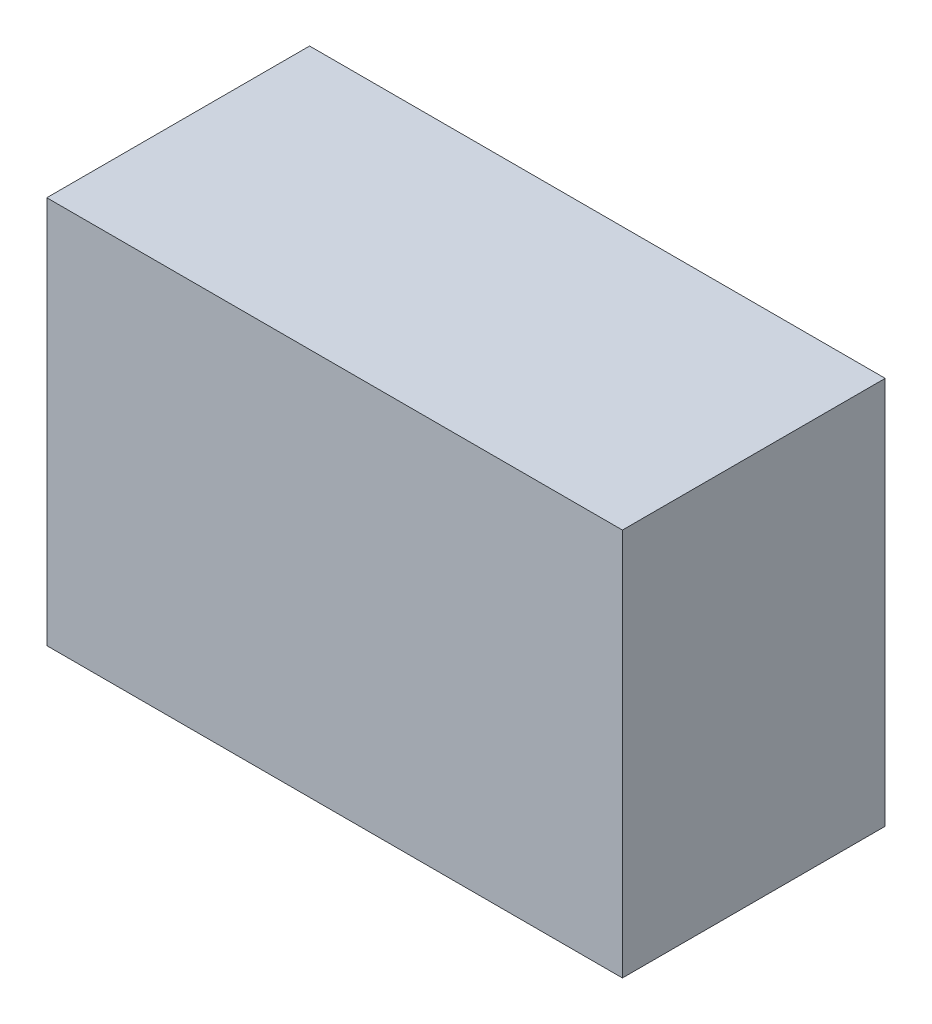
ISO-10303-21;
HEADER;
FILE_DESCRIPTION(('STEP AP214'),'2;1');
FILE_NAME('part.step','',(''),(''),'','','');
FILE_SCHEMA(('AUTOMOTIVE_DESIGN { 1 0 10303 214 1 1 1 1 }'));
ENDSEC;
DATA;
#1=APPLICATION_CONTEXT('core data for automotive mechanical design processes');
#2=APPLICATION_PROTOCOL_DEFINITION('international standard','automotive_design',2000,#1);
#3=PRODUCT_CONTEXT('',#1,'mechanical');
#4=PRODUCT('Part','Part','',(#3));
#5=PRODUCT_RELATED_PRODUCT_CATEGORY('part','',(#4));
#6=PRODUCT_DEFINITION_FORMATION('','',#4);
#7=PRODUCT_DEFINITION_CONTEXT('part definition',#1,'design');
#8=PRODUCT_DEFINITION('design','',#6,#7);
#9=PRODUCT_DEFINITION_SHAPE('','',#8);
#10=(LENGTH_UNIT() NAMED_UNIT(*) SI_UNIT(.MILLI.,.METRE.));
#11=(NAMED_UNIT(*) PLANE_ANGLE_UNIT() SI_UNIT($,.RADIAN.));
#12=(NAMED_UNIT(*) SI_UNIT($,.STERADIAN.) SOLID_ANGLE_UNIT());
#13=UNCERTAINTY_MEASURE_WITH_UNIT(LENGTH_MEASURE(1.E-05),#10,'distance_accuracy_value','');
#14=(GEOMETRIC_REPRESENTATION_CONTEXT(3) GLOBAL_UNCERTAINTY_ASSIGNED_CONTEXT((#13)) GLOBAL_UNIT_ASSIGNED_CONTEXT((#10,
#11,#12)) REPRESENTATION_CONTEXT('',''));
#15=CARTESIAN_POINT('',(0.,0.,0.));
#16=DIRECTION('',(0.,0.,1.));
#17=DIRECTION('',(1.,0.,0.));
#18=AXIS2_PLACEMENT_3D('',#15,#16,#17);
#19=CARTESIAN_POINT('',(-0.999999999999999,5.,9.5));
#20=DIRECTION('',(0.,-1.,0.));
#21=DIRECTION('',(0.,0.,-1.));
#22=AXIS2_PLACEMENT_3D('',#19,#20,#21);
#23=CYLINDRICAL_SURFACE('',#22,1.);
#24=CARTESIAN_POINT('',(-0.999999999999999,5.,9.5));
#25=DIRECTION('',(0.,-1.,0.));
#26=DIRECTION('',(0.,0.,-1.));
#27=AXIS2_PLACEMENT_3D('',#24,#25,#26);
#28=CIRCLE('',#27,1.);
#29=CARTESIAN_POINT('',(-0.999999999999999,5.,8.5));
#30=VERTEX_POINT('',#29);
#31=EDGE_CURVE('E11',#30,#30,#28,.T.);
#32=ORIENTED_EDGE('',*,*,#31,.T.);
#33=EDGE_LOOP('',(#32));
#34=FACE_BOUND('',#33,.T.);
#35=CARTESIAN_POINT('',(-0.999999999999999,-5.,9.5));
#36=DIRECTION('',(0.,-1.,0.));
#37=DIRECTION('',(0.,0.,-1.));
#38=AXIS2_PLACEMENT_3D('',#35,#36,#37);
#39=CIRCLE('',#38,1.);
#40=CARTESIAN_POINT('',(-0.999999999999999,-5.,8.5));
#41=VERTEX_POINT('',#40);
#42=EDGE_CURVE('E56',#41,#41,#39,.T.);
#43=ORIENTED_EDGE('',*,*,#42,.F.);
#44=EDGE_LOOP('',(#43));
#45=FACE_BOUND('',#44,.T.);
#46=ADVANCED_FACE('F50',(#34,#45),#23,.T.);
#47=CARTESIAN_POINT('',(0.,5.,0.));
#48=DIRECTION('',(0.,-1.,0.));
#49=DIRECTION('',(0.,0.,-1.));
#50=AXIS2_PLACEMENT_3D('',#47,#48,#49);
#51=PLANE('',#50);
#52=ORIENTED_EDGE('',*,*,#31,.F.);
#53=EDGE_LOOP('',(#52));
#54=FACE_BOUND('',#53,.T.);
#55=ADVANCED_FACE('F65',(#54),#51,.F.);
#56=CARTESIAN_POINT('',(0.,-5.,0.));
#57=DIRECTION('',(0.,-1.,0.));
#58=DIRECTION('',(0.,0.,-1.));
#59=AXIS2_PLACEMENT_3D('',#56,#57,#58);
#60=PLANE('',#59);
#61=ORIENTED_EDGE('',*,*,#42,.T.);
#62=EDGE_LOOP('',(#61));
#63=FACE_BOUND('',#62,.T.);
#64=ADVANCED_FACE('F62',(#63),#60,.T.);
#65=CLOSED_SHELL('',(#46,#55,#64));
#66=MANIFOLD_SOLID_BREP('B2',#65);
#67=CARTESIAN_POINT('',(-0.999999999999999,5.,11.5));
#68=DIRECTION('',(0.,-1.,0.));
#69=DIRECTION('',(0.,0.,-1.));
#70=AXIS2_PLACEMENT_3D('',#67,#68,#69);
#71=CYLINDRICAL_SURFACE('',#70,1.);
#72=CARTESIAN_POINT('',(-0.999999999999999,5.,11.5));
#73=DIRECTION('',(0.,-1.,0.));
#74=DIRECTION('',(0.,0.,-1.));
#75=AXIS2_PLACEMENT_3D('',#72,#73,#74);
#76=CIRCLE('',#75,1.);
#77=CARTESIAN_POINT('',(-0.999999999999999,5.,10.5));
#78=VERTEX_POINT('',#77);
#79=EDGE_CURVE('E49',#78,#78,#76,.T.);
#80=ORIENTED_EDGE('',*,*,#79,.T.);
#81=EDGE_LOOP('',(#80));
#82=FACE_BOUND('',#81,.T.);
#83=CARTESIAN_POINT('',(-0.999999999999999,-5.,11.5));
#84=DIRECTION('',(0.,-1.,0.));
#85=DIRECTION('',(0.,0.,-1.));
#86=AXIS2_PLACEMENT_3D('',#83,#84,#85);
#87=CIRCLE('',#86,1.);
#88=CARTESIAN_POINT('',(-0.999999999999999,-5.,10.5));
#89=VERTEX_POINT('',#88);
#90=EDGE_CURVE('E106',#89,#89,#87,.T.);
#91=ORIENTED_EDGE('',*,*,#90,.F.);
#92=EDGE_LOOP('',(#91));
#93=FACE_BOUND('',#92,.T.);
#94=ADVANCED_FACE('F100',(#82,#93),#71,.T.);
#95=CARTESIAN_POINT('',(0.,5.,0.));
#96=DIRECTION('',(0.,-1.,0.));
#97=DIRECTION('',(0.,0.,-1.));
#98=AXIS2_PLACEMENT_3D('',#95,#96,#97);
#99=PLANE('',#98);
#100=ORIENTED_EDGE('',*,*,#79,.F.);
#101=EDGE_LOOP('',(#100));
#102=FACE_BOUND('',#101,.T.);
#103=ADVANCED_FACE('F115',(#102),#99,.F.);
#104=CARTESIAN_POINT('',(0.,-5.,0.));
#105=DIRECTION('',(0.,-1.,0.));
#106=DIRECTION('',(0.,0.,-1.));
#107=AXIS2_PLACEMENT_3D('',#104,#105,#106);
#108=PLANE('',#107);
#109=ORIENTED_EDGE('',*,*,#90,.T.);
#110=EDGE_LOOP('',(#109));
#111=FACE_BOUND('',#110,.T.);
#112=ADVANCED_FACE('F112',(#111),#108,.T.);
#113=CLOSED_SHELL('',(#94,#103,#112));
#114=MANIFOLD_SOLID_BREP('B6',#113);
#115=CARTESIAN_POINT('',(0.,0.,21.));
#116=DIRECTION('',(1.,0.,0.));
#117=DIRECTION('',(0.,0.,-1.));
#118=AXIS2_PLACEMENT_3D('',#115,#116,#117);
#119=PLANE('',#118);
#120=DIRECTION('',(0.,-1.,0.));
#121=VECTOR('',#120,1.);
#122=CARTESIAN_POINT('',(0.,0.,0.));
#123=LINE('',#122,#121);
#124=CARTESIAN_POINT('',(0.,31.,0.));
#125=VERTEX_POINT('',#124);
#126=CARTESIAN_POINT('',(0.,0.,0.));
#127=VERTEX_POINT('',#126);
#128=EDGE_CURVE('E204',#125,#127,#123,.T.);
#129=ORIENTED_EDGE('',*,*,#128,.T.);
#130=DIRECTION('',(0.,0.,-1.));
#131=VECTOR('',#130,1.);
#132=CARTESIAN_POINT('',(0.,0.,21.));
#133=LINE('',#132,#131);
#134=CARTESIAN_POINT('',(0.,0.,21.));
#135=VERTEX_POINT('',#134);
#136=EDGE_CURVE('E98',#135,#127,#133,.T.);
#137=ORIENTED_EDGE('',*,*,#136,.F.);
#138=DIRECTION('',(0.,-1.,0.));
#139=VECTOR('',#138,1.);
#140=CARTESIAN_POINT('',(0.,0.,21.));
#141=LINE('',#140,#139);
#142=CARTESIAN_POINT('',(0.,31.,21.));
#143=VERTEX_POINT('',#142);
#144=EDGE_CURVE('E192',#143,#135,#141,.T.);
#145=ORIENTED_EDGE('',*,*,#144,.F.);
#146=DIRECTION('',(0.,0.,-1.));
#147=VECTOR('',#146,1.);
#148=CARTESIAN_POINT('',(0.,31.,21.));
#149=LINE('',#148,#147);
#150=EDGE_CURVE('E200',#143,#125,#149,.T.);
#151=ORIENTED_EDGE('',*,*,#150,.T.);
#152=EDGE_LOOP('',(#129,#137,#145,#151));
#153=FACE_BOUND('',#152,.T.);
#154=ADVANCED_FACE('F141',(#153),#119,.F.);
#155=CARTESIAN_POINT('',(0.,0.,21.));
#156=DIRECTION('',(0.,1.,0.));
#157=DIRECTION('',(0.,0.,1.));
#158=AXIS2_PLACEMENT_3D('',#155,#156,#157);
#159=PLANE('',#158);
#160=DIRECTION('',(1.,0.,0.));
#161=VECTOR('',#160,1.);
#162=CARTESIAN_POINT('',(0.,0.,0.));
#163=LINE('',#162,#161);
#164=CARTESIAN_POINT('',(46.,0.,0.));
#165=VERTEX_POINT('',#164);
#166=EDGE_CURVE('E196',#127,#165,#163,.T.);
#167=ORIENTED_EDGE('',*,*,#166,.T.);
#168=DIRECTION('',(0.,0.,-1.));
#169=VECTOR('',#168,1.);
#170=CARTESIAN_POINT('',(46.,0.,21.));
#171=LINE('',#170,#169);
#172=CARTESIAN_POINT('',(46.,0.,21.));
#173=VERTEX_POINT('',#172);
#174=EDGE_CURVE('E149',#173,#165,#171,.T.);
#175=ORIENTED_EDGE('',*,*,#174,.F.);
#176=DIRECTION('',(1.,0.,0.));
#177=VECTOR('',#176,1.);
#178=CARTESIAN_POINT('',(0.,0.,21.));
#179=LINE('',#178,#177);
#180=EDGE_CURVE('E187',#135,#173,#179,.T.);
#181=ORIENTED_EDGE('',*,*,#180,.F.);
#182=ORIENTED_EDGE('',*,*,#136,.T.);
#183=EDGE_LOOP('',(#167,#175,#181,#182));
#184=FACE_BOUND('',#183,.T.);
#185=ADVANCED_FACE('F195',(#184),#159,.F.);
#186=CARTESIAN_POINT('',(46.,0.,21.));
#187=DIRECTION('',(-1.,0.,0.));
#188=DIRECTION('',(0.,0.,1.));
#189=AXIS2_PLACEMENT_3D('',#186,#187,#188);
#190=PLANE('',#189);
#191=DIRECTION('',(0.,1.,0.));
#192=VECTOR('',#191,1.);
#193=CARTESIAN_POINT('',(46.,0.,0.));
#194=LINE('',#193,#192);
#195=CARTESIAN_POINT('',(46.,31.,0.));
#196=VERTEX_POINT('',#195);
#197=EDGE_CURVE('E174',#165,#196,#194,.T.);
#198=ORIENTED_EDGE('',*,*,#197,.T.);
#199=DIRECTION('',(0.,0.,-1.));
#200=VECTOR('',#199,1.);
#201=CARTESIAN_POINT('',(46.,31.,21.));
#202=LINE('',#201,#200);
#203=CARTESIAN_POINT('',(46.,31.,21.));
#204=VERTEX_POINT('',#203);
#205=EDGE_CURVE('E197',#204,#196,#202,.T.);
#206=ORIENTED_EDGE('',*,*,#205,.F.);
#207=DIRECTION('',(0.,1.,0.));
#208=VECTOR('',#207,1.);
#209=CARTESIAN_POINT('',(46.,0.,21.));
#210=LINE('',#209,#208);
#211=EDGE_CURVE('E190',#173,#204,#210,.T.);
#212=ORIENTED_EDGE('',*,*,#211,.F.);
#213=ORIENTED_EDGE('',*,*,#174,.T.);
#214=EDGE_LOOP('',(#198,#206,#212,#213));
#215=FACE_BOUND('',#214,.T.);
#216=ADVANCED_FACE('F198',(#215),#190,.F.);
#217=CARTESIAN_POINT('',(0.,31.,21.));
#218=DIRECTION('',(0.,-1.,0.));
#219=DIRECTION('',(0.,0.,-1.));
#220=AXIS2_PLACEMENT_3D('',#217,#218,#219);
#221=PLANE('',#220);
#222=DIRECTION('',(-1.,0.,0.));
#223=VECTOR('',#222,1.);
#224=CARTESIAN_POINT('',(0.,31.,0.));
#225=LINE('',#224,#223);
#226=EDGE_CURVE('E180',#196,#125,#225,.T.);
#227=ORIENTED_EDGE('',*,*,#226,.T.);
#228=ORIENTED_EDGE('',*,*,#150,.F.);
#229=DIRECTION('',(-1.,0.,0.));
#230=VECTOR('',#229,1.);
#231=CARTESIAN_POINT('',(0.,31.,21.));
#232=LINE('',#231,#230);
#233=EDGE_CURVE('E157',#204,#143,#232,.T.);
#234=ORIENTED_EDGE('',*,*,#233,.F.);
#235=ORIENTED_EDGE('',*,*,#205,.T.);
#236=EDGE_LOOP('',(#227,#228,#234,#235));
#237=FACE_BOUND('',#236,.T.);
#238=ADVANCED_FACE('F211',(#237),#221,.F.);
#239=CARTESIAN_POINT('',(0.,0.,21.));
#240=DIRECTION('',(0.,0.,-1.));
#241=DIRECTION('',(-1.,0.,0.));
#242=AXIS2_PLACEMENT_3D('',#239,#240,#241);
#243=PLANE('',#242);
#244=ORIENTED_EDGE('',*,*,#144,.T.);
#245=ORIENTED_EDGE('',*,*,#180,.T.);
#246=ORIENTED_EDGE('',*,*,#211,.T.);
#247=ORIENTED_EDGE('',*,*,#233,.T.);
#248=EDGE_LOOP('',(#244,#245,#246,#247));
#249=FACE_BOUND('',#248,.T.);
#250=ADVANCED_FACE('F188',(#249),#243,.F.);
#251=CARTESIAN_POINT('',(0.,0.,0.));
#252=DIRECTION('',(0.,0.,-1.));
#253=DIRECTION('',(-1.,0.,0.));
#254=AXIS2_PLACEMENT_3D('',#251,#252,#253);
#255=PLANE('',#254);
#256=ORIENTED_EDGE('',*,*,#128,.F.);
#257=ORIENTED_EDGE('',*,*,#226,.F.);
#258=ORIENTED_EDGE('',*,*,#197,.F.);
#259=ORIENTED_EDGE('',*,*,#166,.F.);
#260=EDGE_LOOP('',(#256,#257,#258,#259));
#261=FACE_BOUND('',#260,.T.);
#262=ADVANCED_FACE('F214',(#261),#255,.T.);
#263=CLOSED_SHELL('',(#154,#185,#216,#238,#250,#262));
#264=MANIFOLD_SOLID_BREP('B44',#263);
#265=ADVANCED_BREP_SHAPE_REPRESENTATION('',(#18,#66,#114,#264),#14);
#266=SHAPE_DEFINITION_REPRESENTATION(#9,#265);
ENDSEC;
END-ISO-10303-21;
